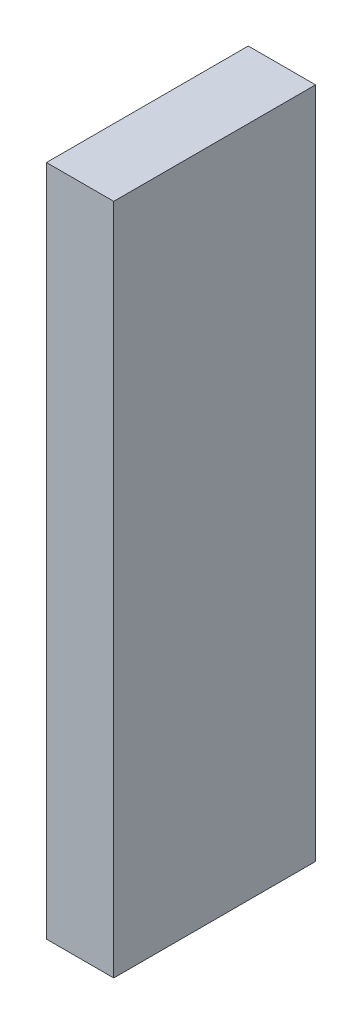
ISO-10303-21;
HEADER;
FILE_DESCRIPTION(('STEP AP214'),'2;1');
FILE_NAME('part.step','',(''),(''),'','','');
FILE_SCHEMA(('AUTOMOTIVE_DESIGN { 1 0 10303 214 1 1 1 1 }'));
ENDSEC;
DATA;
#1=APPLICATION_CONTEXT('core data for automotive mechanical design processes');
#2=APPLICATION_PROTOCOL_DEFINITION('international standard','automotive_design',2000,#1);
#3=PRODUCT_CONTEXT('',#1,'mechanical');
#4=PRODUCT('Part','Part','',(#3));
#5=PRODUCT_RELATED_PRODUCT_CATEGORY('part','',(#4));
#6=PRODUCT_DEFINITION_FORMATION('','',#4);
#7=PRODUCT_DEFINITION_CONTEXT('part definition',#1,'design');
#8=PRODUCT_DEFINITION('design','',#6,#7);
#9=PRODUCT_DEFINITION_SHAPE('','',#8);
#10=(LENGTH_UNIT() NAMED_UNIT(*) SI_UNIT(.MILLI.,.METRE.));
#11=(NAMED_UNIT(*) PLANE_ANGLE_UNIT() SI_UNIT($,.RADIAN.));
#12=(NAMED_UNIT(*) SI_UNIT($,.STERADIAN.) SOLID_ANGLE_UNIT());
#13=UNCERTAINTY_MEASURE_WITH_UNIT(LENGTH_MEASURE(1.E-05),#10,'distance_accuracy_value','');
#14=(GEOMETRIC_REPRESENTATION_CONTEXT(3) GLOBAL_UNCERTAINTY_ASSIGNED_CONTEXT((#13)) GLOBAL_UNIT_ASSIGNED_CONTEXT((#10,
#11,#12)) REPRESENTATION_CONTEXT('',''));
#15=CARTESIAN_POINT('',(0.,0.,0.));
#16=DIRECTION('',(0.,0.,1.));
#17=DIRECTION('',(1.,0.,0.));
#18=AXIS2_PLACEMENT_3D('',#15,#16,#17);
#19=CARTESIAN_POINT('',(3.175,-15.875,-4.7625));
#20=DIRECTION('',(0.,0.,1.));
#21=DIRECTION('',(1.,0.,0.));
#22=AXIS2_PLACEMENT_3D('',#19,#20,#21);
#23=PLANE('',#22);
#24=DIRECTION('',(0.,1.,0.));
#25=VECTOR('',#24,1.);
#26=CARTESIAN_POINT('',(0.,-15.875,-4.7625));
#27=LINE('',#26,#25);
#28=CARTESIAN_POINT('',(0.,-15.875,-4.7625));
#29=VERTEX_POINT('',#28);
#30=CARTESIAN_POINT('',(0.,15.875,-4.7625));
#31=VERTEX_POINT('',#30);
#32=EDGE_CURVE('E98',#29,#31,#27,.T.);
#33=ORIENTED_EDGE('',*,*,#32,.T.);
#34=DIRECTION('',(-1.,0.,0.));
#35=VECTOR('',#34,1.);
#36=CARTESIAN_POINT('',(3.175,15.875,-4.7625));
#37=LINE('',#36,#35);
#38=CARTESIAN_POINT('',(3.175,15.875,-4.7625));
#39=VERTEX_POINT('',#38);
#40=EDGE_CURVE('E11',#39,#31,#37,.T.);
#41=ORIENTED_EDGE('',*,*,#40,.F.);
#42=DIRECTION('',(0.,1.,0.));
#43=VECTOR('',#42,1.);
#44=CARTESIAN_POINT('',(3.175,-15.875,-4.7625));
#45=LINE('',#44,#43);
#46=CARTESIAN_POINT('',(3.175,-15.875,-4.7625));
#47=VERTEX_POINT('',#46);
#48=EDGE_CURVE('E86',#47,#39,#45,.T.);
#49=ORIENTED_EDGE('',*,*,#48,.F.);
#50=DIRECTION('',(-1.,0.,0.));
#51=VECTOR('',#50,1.);
#52=CARTESIAN_POINT('',(3.175,-15.875,-4.7625));
#53=LINE('',#52,#51);
#54=EDGE_CURVE('E94',#47,#29,#53,.T.);
#55=ORIENTED_EDGE('',*,*,#54,.T.);
#56=EDGE_LOOP('',(#33,#41,#49,#55));
#57=FACE_BOUND('',#56,.T.);
#58=ADVANCED_FACE('F35',(#57),#23,.F.);
#59=CARTESIAN_POINT('',(3.175,15.875,4.7625));
#60=DIRECTION('',(0.,-1.,0.));
#61=DIRECTION('',(0.,0.,-1.));
#62=AXIS2_PLACEMENT_3D('',#59,#60,#61);
#63=PLANE('',#62);
#64=DIRECTION('',(0.,0.,1.));
#65=VECTOR('',#64,1.);
#66=CARTESIAN_POINT('',(0.,15.875,4.7625));
#67=LINE('',#66,#65);
#68=CARTESIAN_POINT('',(0.,15.875,4.7625));
#69=VERTEX_POINT('',#68);
#70=EDGE_CURVE('E90',#31,#69,#67,.T.);
#71=ORIENTED_EDGE('',*,*,#70,.T.);
#72=DIRECTION('',(-1.,0.,0.));
#73=VECTOR('',#72,1.);
#74=CARTESIAN_POINT('',(3.175,15.875,4.7625));
#75=LINE('',#74,#73);
#76=CARTESIAN_POINT('',(3.175,15.875,4.7625));
#77=VERTEX_POINT('',#76);
#78=EDGE_CURVE('E43',#77,#69,#75,.T.);
#79=ORIENTED_EDGE('',*,*,#78,.F.);
#80=DIRECTION('',(0.,0.,1.));
#81=VECTOR('',#80,1.);
#82=CARTESIAN_POINT('',(3.175,15.875,4.7625));
#83=LINE('',#82,#81);
#84=EDGE_CURVE('E81',#39,#77,#83,.T.);
#85=ORIENTED_EDGE('',*,*,#84,.F.);
#86=ORIENTED_EDGE('',*,*,#40,.T.);
#87=EDGE_LOOP('',(#71,#79,#85,#86));
#88=FACE_BOUND('',#87,.T.);
#89=ADVANCED_FACE('F89',(#88),#63,.F.);
#90=CARTESIAN_POINT('',(3.175,-15.875,4.7625));
#91=DIRECTION('',(0.,0.,-1.));
#92=DIRECTION('',(-1.,0.,0.));
#93=AXIS2_PLACEMENT_3D('',#90,#91,#92);
#94=PLANE('',#93);
#95=DIRECTION('',(0.,-1.,0.));
#96=VECTOR('',#95,1.);
#97=CARTESIAN_POINT('',(0.,-15.875,4.7625));
#98=LINE('',#97,#96);
#99=CARTESIAN_POINT('',(0.,-15.875,4.7625));
#100=VERTEX_POINT('',#99);
#101=EDGE_CURVE('E68',#69,#100,#98,.T.);
#102=ORIENTED_EDGE('',*,*,#101,.T.);
#103=DIRECTION('',(-1.,0.,0.));
#104=VECTOR('',#103,1.);
#105=CARTESIAN_POINT('',(3.175,-15.875,4.7625));
#106=LINE('',#105,#104);
#107=CARTESIAN_POINT('',(3.175,-15.875,4.7625));
#108=VERTEX_POINT('',#107);
#109=EDGE_CURVE('E91',#108,#100,#106,.T.);
#110=ORIENTED_EDGE('',*,*,#109,.F.);
#111=DIRECTION('',(0.,-1.,0.));
#112=VECTOR('',#111,1.);
#113=CARTESIAN_POINT('',(3.175,-15.875,4.7625));
#114=LINE('',#113,#112);
#115=EDGE_CURVE('E84',#77,#108,#114,.T.);
#116=ORIENTED_EDGE('',*,*,#115,.F.);
#117=ORIENTED_EDGE('',*,*,#78,.T.);
#118=EDGE_LOOP('',(#102,#110,#116,#117));
#119=FACE_BOUND('',#118,.T.);
#120=ADVANCED_FACE('F92',(#119),#94,.F.);
#121=CARTESIAN_POINT('',(3.175,-15.875,4.7625));
#122=DIRECTION('',(0.,1.,0.));
#123=DIRECTION('',(0.,0.,1.));
#124=AXIS2_PLACEMENT_3D('',#121,#122,#123);
#125=PLANE('',#124);
#126=DIRECTION('',(0.,0.,-1.));
#127=VECTOR('',#126,1.);
#128=CARTESIAN_POINT('',(0.,-15.875,4.7625));
#129=LINE('',#128,#127);
#130=EDGE_CURVE('E74',#100,#29,#129,.T.);
#131=ORIENTED_EDGE('',*,*,#130,.T.);
#132=ORIENTED_EDGE('',*,*,#54,.F.);
#133=DIRECTION('',(0.,0.,-1.));
#134=VECTOR('',#133,1.);
#135=CARTESIAN_POINT('',(3.175,-15.875,4.7625));
#136=LINE('',#135,#134);
#137=EDGE_CURVE('E51',#108,#47,#136,.T.);
#138=ORIENTED_EDGE('',*,*,#137,.F.);
#139=ORIENTED_EDGE('',*,*,#109,.T.);
#140=EDGE_LOOP('',(#131,#132,#138,#139));
#141=FACE_BOUND('',#140,.T.);
#142=ADVANCED_FACE('F105',(#141),#125,.F.);
#143=CARTESIAN_POINT('',(3.175,15.875,-4.7625));
#144=DIRECTION('',(-1.,0.,0.));
#145=DIRECTION('',(0.,0.,1.));
#146=AXIS2_PLACEMENT_3D('',#143,#144,#145);
#147=PLANE('',#146);
#148=ORIENTED_EDGE('',*,*,#48,.T.);
#149=ORIENTED_EDGE('',*,*,#84,.T.);
#150=ORIENTED_EDGE('',*,*,#115,.T.);
#151=ORIENTED_EDGE('',*,*,#137,.T.);
#152=EDGE_LOOP('',(#148,#149,#150,#151));
#153=FACE_BOUND('',#152,.T.);
#154=ADVANCED_FACE('F82',(#153),#147,.F.);
#155=CARTESIAN_POINT('',(0.,15.875,-4.7625));
#156=DIRECTION('',(-1.,0.,0.));
#157=DIRECTION('',(0.,0.,1.));
#158=AXIS2_PLACEMENT_3D('',#155,#156,#157);
#159=PLANE('',#158);
#160=ORIENTED_EDGE('',*,*,#32,.F.);
#161=ORIENTED_EDGE('',*,*,#130,.F.);
#162=ORIENTED_EDGE('',*,*,#101,.F.);
#163=ORIENTED_EDGE('',*,*,#70,.F.);
#164=EDGE_LOOP('',(#160,#161,#162,#163));
#165=FACE_BOUND('',#164,.T.);
#166=ADVANCED_FACE('F108',(#165),#159,.T.);
#167=CLOSED_SHELL('',(#58,#89,#120,#142,#154,#166));
#168=MANIFOLD_SOLID_BREP('B2',#167);
#169=ADVANCED_BREP_SHAPE_REPRESENTATION('',(#18,#168),#14);
#170=SHAPE_DEFINITION_REPRESENTATION(#9,#169);
ENDSEC;
END-ISO-10303-21;
